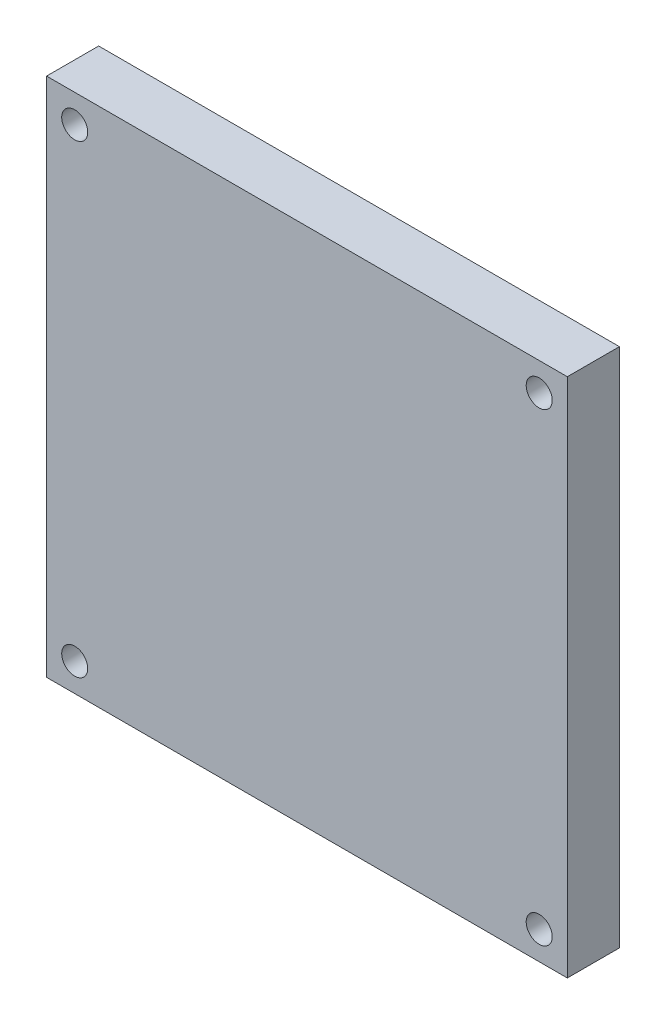
ISO-10303-21;
HEADER;
FILE_DESCRIPTION(('STEP AP214'),'2;1');
FILE_NAME('part.step','',(''),(''),'','','');
FILE_SCHEMA(('AUTOMOTIVE_DESIGN { 1 0 10303 214 1 1 1 1 }'));
ENDSEC;
DATA;
#1=APPLICATION_CONTEXT('core data for automotive mechanical design processes');
#2=APPLICATION_PROTOCOL_DEFINITION('international standard','automotive_design',2000,#1);
#3=PRODUCT_CONTEXT('',#1,'mechanical');
#4=PRODUCT('Part','Part','',(#3));
#5=PRODUCT_RELATED_PRODUCT_CATEGORY('part','',(#4));
#6=PRODUCT_DEFINITION_FORMATION('','',#4);
#7=PRODUCT_DEFINITION_CONTEXT('part definition',#1,'design');
#8=PRODUCT_DEFINITION('design','',#6,#7);
#9=PRODUCT_DEFINITION_SHAPE('','',#8);
#10=(LENGTH_UNIT() NAMED_UNIT(*) SI_UNIT(.MILLI.,.METRE.));
#11=(NAMED_UNIT(*) PLANE_ANGLE_UNIT() SI_UNIT($,.RADIAN.));
#12=(NAMED_UNIT(*) SI_UNIT($,.STERADIAN.) SOLID_ANGLE_UNIT());
#13=UNCERTAINTY_MEASURE_WITH_UNIT(LENGTH_MEASURE(1.E-05),#10,'distance_accuracy_value','');
#14=(GEOMETRIC_REPRESENTATION_CONTEXT(3) GLOBAL_UNCERTAINTY_ASSIGNED_CONTEXT((#13)) GLOBAL_UNIT_ASSIGNED_CONTEXT((#10,
#11,#12)) REPRESENTATION_CONTEXT('',''));
#15=CARTESIAN_POINT('',(0.,0.,0.));
#16=DIRECTION('',(0.,0.,1.));
#17=DIRECTION('',(1.,0.,0.));
#18=AXIS2_PLACEMENT_3D('',#15,#16,#17);
#19=CARTESIAN_POINT('',(0.,0.,5.));
#20=DIRECTION('',(0.,0.,-1.));
#21=DIRECTION('',(-1.,0.,0.));
#22=AXIS2_PLACEMENT_3D('',#19,#20,#21);
#23=PLANE('',#22);
#24=DIRECTION('',(0.,1.,0.));
#25=VECTOR('',#24,1.);
#26=CARTESIAN_POINT('',(0.,50.,5.));
#27=LINE('',#26,#25);
#28=CARTESIAN_POINT('',(0.,0.,5.));
#29=VERTEX_POINT('',#28);
#30=CARTESIAN_POINT('',(0.,50.,5.));
#31=VERTEX_POINT('',#30);
#32=EDGE_CURVE('E92',#29,#31,#27,.T.);
#33=ORIENTED_EDGE('',*,*,#32,.T.);
#34=DIRECTION('',(-1.,0.,0.));
#35=VECTOR('',#34,1.);
#36=CARTESIAN_POINT('',(-50.,50.,5.));
#37=LINE('',#36,#35);
#38=CARTESIAN_POINT('',(-50.,50.,5.));
#39=VERTEX_POINT('',#38);
#40=EDGE_CURVE('E87',#31,#39,#37,.T.);
#41=ORIENTED_EDGE('',*,*,#40,.T.);
#42=DIRECTION('',(0.,-1.,0.));
#43=VECTOR('',#42,1.);
#44=CARTESIAN_POINT('',(-50.,0.,5.));
#45=LINE('',#44,#43);
#46=CARTESIAN_POINT('',(-50.,0.,5.));
#47=VERTEX_POINT('',#46);
#48=EDGE_CURVE('E90',#39,#47,#45,.T.);
#49=ORIENTED_EDGE('',*,*,#48,.T.);
#50=DIRECTION('',(1.,0.,0.));
#51=VECTOR('',#50,1.);
#52=CARTESIAN_POINT('',(0.,0.,5.));
#53=LINE('',#52,#51);
#54=EDGE_CURVE('E57',#47,#29,#53,.T.);
#55=ORIENTED_EDGE('',*,*,#54,.T.);
#56=EDGE_LOOP('',(#33,#41,#49,#55));
#57=FACE_BOUND('',#56,.T.);
#58=CARTESIAN_POINT('',(-47.3,47.3,5.));
#59=DIRECTION('',(0.,0.,1.));
#60=DIRECTION('',(1.,0.,0.));
#61=AXIS2_PLACEMENT_3D('',#58,#59,#60);
#62=CIRCLE('',#61,1.25);
#63=CARTESIAN_POINT('',(-46.05,47.3,5.));
#64=VERTEX_POINT('',#63);
#65=EDGE_CURVE('E112',#64,#64,#62,.T.);
#66=ORIENTED_EDGE('',*,*,#65,.F.);
#67=EDGE_LOOP('',(#66));
#68=FACE_BOUND('',#67,.T.);
#69=CARTESIAN_POINT('',(-2.7,47.3,5.));
#70=DIRECTION('',(0.,0.,1.));
#71=DIRECTION('',(-1.,0.,0.));
#72=AXIS2_PLACEMENT_3D('',#69,#70,#71);
#73=CIRCLE('',#72,1.25);
#74=CARTESIAN_POINT('',(-3.95,47.3,5.));
#75=VERTEX_POINT('',#74);
#76=EDGE_CURVE('E134',#75,#75,#73,.T.);
#77=ORIENTED_EDGE('',*,*,#76,.F.);
#78=EDGE_LOOP('',(#77));
#79=FACE_BOUND('',#78,.T.);
#80=CARTESIAN_POINT('',(-47.3,2.7,5.));
#81=DIRECTION('',(0.,0.,1.));
#82=DIRECTION('',(-1.,0.,0.));
#83=AXIS2_PLACEMENT_3D('',#80,#81,#82);
#84=CIRCLE('',#83,1.25);
#85=CARTESIAN_POINT('',(-48.55,2.7,5.));
#86=VERTEX_POINT('',#85);
#87=EDGE_CURVE('E142',#86,#86,#84,.T.);
#88=ORIENTED_EDGE('',*,*,#87,.F.);
#89=EDGE_LOOP('',(#88));
#90=FACE_BOUND('',#89,.T.);
#91=CARTESIAN_POINT('',(-2.7,2.7,5.));
#92=DIRECTION('',(0.,0.,1.));
#93=DIRECTION('',(1.,0.,0.));
#94=AXIS2_PLACEMENT_3D('',#91,#92,#93);
#95=CIRCLE('',#94,1.25);
#96=CARTESIAN_POINT('',(-1.45,2.7,5.));
#97=VERTEX_POINT('',#96);
#98=EDGE_CURVE('E150',#97,#97,#95,.T.);
#99=ORIENTED_EDGE('',*,*,#98,.F.);
#100=EDGE_LOOP('',(#99));
#101=FACE_BOUND('',#100,.T.);
#102=ADVANCED_FACE('F39',(#57,#68,#79,#90,#101),#23,.F.);
#103=CARTESIAN_POINT('',(0.,0.,0.));
#104=DIRECTION('',(0.,0.,-1.));
#105=DIRECTION('',(-1.,0.,0.));
#106=AXIS2_PLACEMENT_3D('',#103,#104,#105);
#107=PLANE('',#106);
#108=CARTESIAN_POINT('',(-47.3,2.7,0.));
#109=DIRECTION('',(0.,0.,1.));
#110=DIRECTION('',(-1.,0.,0.));
#111=AXIS2_PLACEMENT_3D('',#108,#109,#110);
#112=CIRCLE('',#111,1.25);
#113=CARTESIAN_POINT('',(-48.55,2.7,0.));
#114=VERTEX_POINT('',#113);
#115=EDGE_CURVE('E146',#114,#114,#112,.T.);
#116=ORIENTED_EDGE('',*,*,#115,.T.);
#117=EDGE_LOOP('',(#116));
#118=FACE_BOUND('',#117,.T.);
#119=CARTESIAN_POINT('',(-47.3,47.3,0.));
#120=DIRECTION('',(0.,0.,1.));
#121=DIRECTION('',(1.,0.,0.));
#122=AXIS2_PLACEMENT_3D('',#119,#120,#121);
#123=CIRCLE('',#122,1.25);
#124=CARTESIAN_POINT('',(-46.05,47.3,0.));
#125=VERTEX_POINT('',#124);
#126=EDGE_CURVE('E130',#125,#125,#123,.T.);
#127=ORIENTED_EDGE('',*,*,#126,.T.);
#128=EDGE_LOOP('',(#127));
#129=FACE_BOUND('',#128,.T.);
#130=DIRECTION('',(0.,1.,0.));
#131=VECTOR('',#130,1.);
#132=CARTESIAN_POINT('',(0.,50.,0.));
#133=LINE('',#132,#131);
#134=CARTESIAN_POINT('',(0.,0.,0.));
#135=VERTEX_POINT('',#134);
#136=CARTESIAN_POINT('',(0.,50.,0.));
#137=VERTEX_POINT('',#136);
#138=EDGE_CURVE('E108',#135,#137,#133,.T.);
#139=ORIENTED_EDGE('',*,*,#138,.F.);
#140=DIRECTION('',(1.,0.,0.));
#141=VECTOR('',#140,1.);
#142=CARTESIAN_POINT('',(0.,0.,0.));
#143=LINE('',#142,#141);
#144=CARTESIAN_POINT('',(-50.,0.,0.));
#145=VERTEX_POINT('',#144);
#146=EDGE_CURVE('E80',#145,#135,#143,.T.);
#147=ORIENTED_EDGE('',*,*,#146,.F.);
#148=DIRECTION('',(0.,-1.,0.));
#149=VECTOR('',#148,1.);
#150=CARTESIAN_POINT('',(-50.,0.,0.));
#151=LINE('',#150,#149);
#152=CARTESIAN_POINT('',(-50.,50.,0.));
#153=VERTEX_POINT('',#152);
#154=EDGE_CURVE('E74',#153,#145,#151,.T.);
#155=ORIENTED_EDGE('',*,*,#154,.F.);
#156=DIRECTION('',(-1.,0.,0.));
#157=VECTOR('',#156,1.);
#158=CARTESIAN_POINT('',(-50.,50.,0.));
#159=LINE('',#158,#157);
#160=EDGE_CURVE('E97',#137,#153,#159,.T.);
#161=ORIENTED_EDGE('',*,*,#160,.F.);
#162=EDGE_LOOP('',(#139,#147,#155,#161));
#163=FACE_BOUND('',#162,.T.);
#164=CARTESIAN_POINT('',(-2.7,47.3,0.));
#165=DIRECTION('',(0.,0.,1.));
#166=DIRECTION('',(-1.,0.,0.));
#167=AXIS2_PLACEMENT_3D('',#164,#165,#166);
#168=CIRCLE('',#167,1.25);
#169=CARTESIAN_POINT('',(-3.95,47.3,0.));
#170=VERTEX_POINT('',#169);
#171=EDGE_CURVE('E138',#170,#170,#168,.T.);
#172=ORIENTED_EDGE('',*,*,#171,.T.);
#173=EDGE_LOOP('',(#172));
#174=FACE_BOUND('',#173,.T.);
#175=CARTESIAN_POINT('',(-2.7,2.7,0.));
#176=DIRECTION('',(0.,0.,1.));
#177=DIRECTION('',(1.,0.,0.));
#178=AXIS2_PLACEMENT_3D('',#175,#176,#177);
#179=CIRCLE('',#178,1.25);
#180=CARTESIAN_POINT('',(-1.45,2.7,0.));
#181=VERTEX_POINT('',#180);
#182=EDGE_CURVE('E154',#181,#181,#179,.T.);
#183=ORIENTED_EDGE('',*,*,#182,.T.);
#184=EDGE_LOOP('',(#183));
#185=FACE_BOUND('',#184,.T.);
#186=ADVANCED_FACE('F125',(#118,#129,#163,#174,#185),#107,.T.);
#187=CARTESIAN_POINT('',(0.,50.,5.));
#188=DIRECTION('',(-1.,0.,0.));
#189=DIRECTION('',(0.,0.,1.));
#190=AXIS2_PLACEMENT_3D('',#187,#188,#189);
#191=PLANE('',#190);
#192=ORIENTED_EDGE('',*,*,#138,.T.);
#193=DIRECTION('',(0.,0.,-1.));
#194=VECTOR('',#193,1.);
#195=CARTESIAN_POINT('',(0.,50.,5.));
#196=LINE('',#195,#194);
#197=EDGE_CURVE('E11',#31,#137,#196,.T.);
#198=ORIENTED_EDGE('',*,*,#197,.F.);
#199=ORIENTED_EDGE('',*,*,#32,.F.);
#200=DIRECTION('',(0.,0.,-1.));
#201=VECTOR('',#200,1.);
#202=CARTESIAN_POINT('',(0.,0.,5.));
#203=LINE('',#202,#201);
#204=EDGE_CURVE('E104',#29,#135,#203,.T.);
#205=ORIENTED_EDGE('',*,*,#204,.T.);
#206=EDGE_LOOP('',(#192,#198,#199,#205));
#207=FACE_BOUND('',#206,.T.);
#208=ADVANCED_FACE('F41',(#207),#191,.F.);
#209=CARTESIAN_POINT('',(-50.,50.,5.));
#210=DIRECTION('',(0.,-1.,0.));
#211=DIRECTION('',(0.,0.,-1.));
#212=AXIS2_PLACEMENT_3D('',#209,#210,#211);
#213=PLANE('',#212);
#214=ORIENTED_EDGE('',*,*,#160,.T.);
#215=DIRECTION('',(0.,0.,-1.));
#216=VECTOR('',#215,1.);
#217=CARTESIAN_POINT('',(-50.,50.,5.));
#218=LINE('',#217,#216);
#219=EDGE_CURVE('E49',#39,#153,#218,.T.);
#220=ORIENTED_EDGE('',*,*,#219,.F.);
#221=ORIENTED_EDGE('',*,*,#40,.F.);
#222=ORIENTED_EDGE('',*,*,#197,.T.);
#223=EDGE_LOOP('',(#214,#220,#221,#222));
#224=FACE_BOUND('',#223,.T.);
#225=ADVANCED_FACE('F96',(#224),#213,.F.);
#226=CARTESIAN_POINT('',(-50.,0.,5.));
#227=DIRECTION('',(1.,0.,0.));
#228=DIRECTION('',(0.,0.,-1.));
#229=AXIS2_PLACEMENT_3D('',#226,#227,#228);
#230=PLANE('',#229);
#231=ORIENTED_EDGE('',*,*,#154,.T.);
#232=DIRECTION('',(0.,0.,-1.));
#233=VECTOR('',#232,1.);
#234=CARTESIAN_POINT('',(-50.,0.,5.));
#235=LINE('',#234,#233);
#236=EDGE_CURVE('E99',#47,#145,#235,.T.);
#237=ORIENTED_EDGE('',*,*,#236,.F.);
#238=ORIENTED_EDGE('',*,*,#48,.F.);
#239=ORIENTED_EDGE('',*,*,#219,.T.);
#240=EDGE_LOOP('',(#231,#237,#238,#239));
#241=FACE_BOUND('',#240,.T.);
#242=ADVANCED_FACE('F100',(#241),#230,.F.);
#243=CARTESIAN_POINT('',(0.,0.,5.));
#244=DIRECTION('',(0.,1.,0.));
#245=DIRECTION('',(-1.,0.,0.));
#246=AXIS2_PLACEMENT_3D('',#243,#244,#245);
#247=PLANE('',#246);
#248=ORIENTED_EDGE('',*,*,#146,.T.);
#249=ORIENTED_EDGE('',*,*,#204,.F.);
#250=ORIENTED_EDGE('',*,*,#54,.F.);
#251=ORIENTED_EDGE('',*,*,#236,.T.);
#252=EDGE_LOOP('',(#248,#249,#250,#251));
#253=FACE_BOUND('',#252,.T.);
#254=ADVANCED_FACE('F122',(#253),#247,.F.);
#255=CARTESIAN_POINT('',(-47.3,47.3,5.));
#256=DIRECTION('',(0.,0.,-1.));
#257=DIRECTION('',(-1.,0.,0.));
#258=AXIS2_PLACEMENT_3D('',#255,#256,#257);
#259=CYLINDRICAL_SURFACE('',#258,1.25);
#260=ORIENTED_EDGE('',*,*,#65,.T.);
#261=EDGE_LOOP('',(#260));
#262=FACE_BOUND('',#261,.T.);
#263=ORIENTED_EDGE('',*,*,#126,.F.);
#264=EDGE_LOOP('',(#263));
#265=FACE_BOUND('',#264,.T.);
#266=ADVANCED_FACE('F173',(#262,#265),#259,.F.);
#267=CARTESIAN_POINT('',(-2.7,47.3,5.));
#268=DIRECTION('',(0.,0.,-1.));
#269=DIRECTION('',(-1.,0.,0.));
#270=AXIS2_PLACEMENT_3D('',#267,#268,#269);
#271=CYLINDRICAL_SURFACE('',#270,1.25);
#272=ORIENTED_EDGE('',*,*,#76,.T.);
#273=EDGE_LOOP('',(#272));
#274=FACE_BOUND('',#273,.T.);
#275=ORIENTED_EDGE('',*,*,#171,.F.);
#276=EDGE_LOOP('',(#275));
#277=FACE_BOUND('',#276,.T.);
#278=ADVANCED_FACE('F219',(#274,#277),#271,.F.);
#279=CARTESIAN_POINT('',(-47.3,2.7,5.));
#280=DIRECTION('',(0.,0.,-1.));
#281=DIRECTION('',(-1.,0.,0.));
#282=AXIS2_PLACEMENT_3D('',#279,#280,#281);
#283=CYLINDRICAL_SURFACE('',#282,1.25);
#284=ORIENTED_EDGE('',*,*,#87,.T.);
#285=EDGE_LOOP('',(#284));
#286=FACE_BOUND('',#285,.T.);
#287=ORIENTED_EDGE('',*,*,#115,.F.);
#288=EDGE_LOOP('',(#287));
#289=FACE_BOUND('',#288,.T.);
#290=ADVANCED_FACE('F227',(#286,#289),#283,.F.);
#291=CARTESIAN_POINT('',(-2.7,2.7,5.));
#292=DIRECTION('',(0.,0.,-1.));
#293=DIRECTION('',(-1.,0.,0.));
#294=AXIS2_PLACEMENT_3D('',#291,#292,#293);
#295=CYLINDRICAL_SURFACE('',#294,1.25);
#296=ORIENTED_EDGE('',*,*,#98,.T.);
#297=EDGE_LOOP('',(#296));
#298=FACE_BOUND('',#297,.T.);
#299=ORIENTED_EDGE('',*,*,#182,.F.);
#300=EDGE_LOOP('',(#299));
#301=FACE_BOUND('',#300,.T.);
#302=ADVANCED_FACE('F162',(#298,#301),#295,.F.);
#303=CLOSED_SHELL('',(#102,#186,#208,#225,#242,#254,#266,#278,#290,#302));
#304=MANIFOLD_SOLID_BREP('B2',#303);
#305=ADVANCED_BREP_SHAPE_REPRESENTATION('',(#18,#304),#14);
#306=SHAPE_DEFINITION_REPRESENTATION(#9,#305);
ENDSEC;
END-ISO-10303-21;
